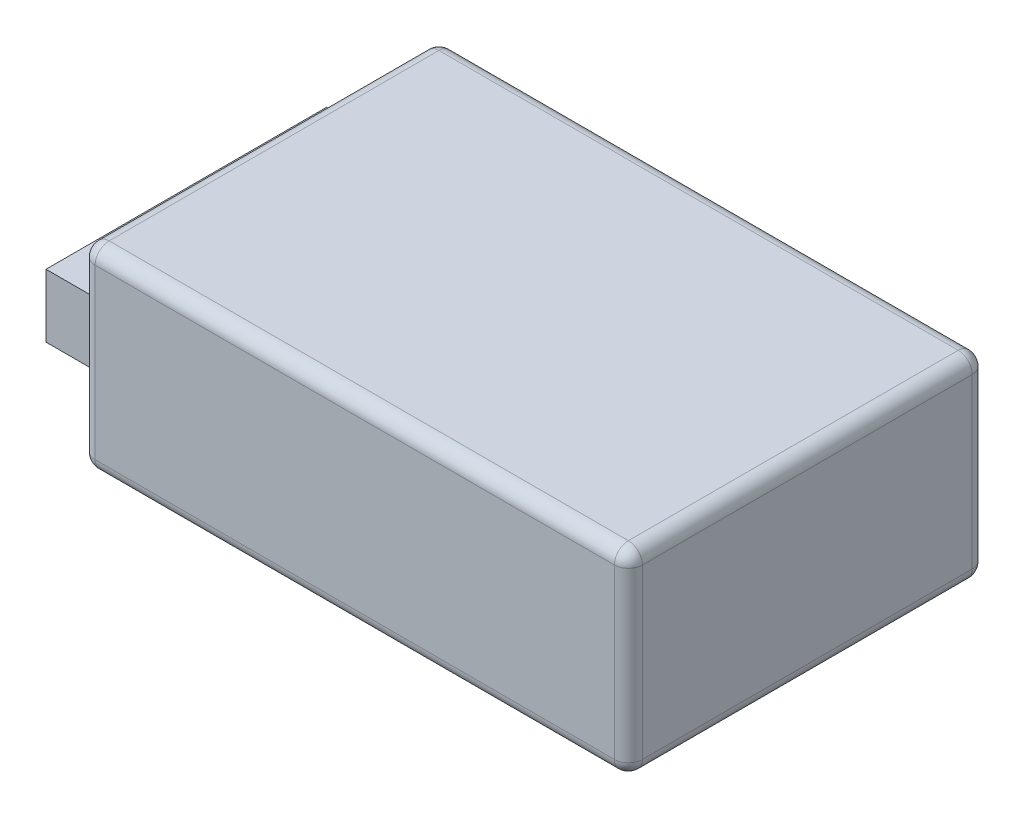
ISO-10303-21;
HEADER;
FILE_DESCRIPTION(('STEP AP214'),'2;1');
FILE_NAME('part.step','',(''),(''),'','','');
FILE_SCHEMA(('AUTOMOTIVE_DESIGN { 1 0 10303 214 1 1 1 1 }'));
ENDSEC;
DATA;
#1=APPLICATION_CONTEXT('core data for automotive mechanical design processes');
#2=APPLICATION_PROTOCOL_DEFINITION('international standard','automotive_design',2000,#1);
#3=PRODUCT_CONTEXT('',#1,'mechanical');
#4=PRODUCT('Part','Part','',(#3));
#5=PRODUCT_RELATED_PRODUCT_CATEGORY('part','',(#4));
#6=PRODUCT_DEFINITION_FORMATION('','',#4);
#7=PRODUCT_DEFINITION_CONTEXT('part definition',#1,'design');
#8=PRODUCT_DEFINITION('design','',#6,#7);
#9=PRODUCT_DEFINITION_SHAPE('','',#8);
#10=(LENGTH_UNIT() NAMED_UNIT(*) SI_UNIT(.MILLI.,.METRE.));
#11=(NAMED_UNIT(*) PLANE_ANGLE_UNIT() SI_UNIT($,.RADIAN.));
#12=(NAMED_UNIT(*) SI_UNIT($,.STERADIAN.) SOLID_ANGLE_UNIT());
#13=UNCERTAINTY_MEASURE_WITH_UNIT(LENGTH_MEASURE(1.E-05),#10,'distance_accuracy_value','');
#14=(GEOMETRIC_REPRESENTATION_CONTEXT(3) GLOBAL_UNCERTAINTY_ASSIGNED_CONTEXT((#13)) GLOBAL_UNIT_ASSIGNED_CONTEXT((#10,
#11,#12)) REPRESENTATION_CONTEXT('',''));
#15=CARTESIAN_POINT('',(0.,0.,0.));
#16=DIRECTION('',(0.,0.,1.));
#17=DIRECTION('',(1.,0.,0.));
#18=AXIS2_PLACEMENT_3D('',#15,#16,#17);
#19=CARTESIAN_POINT('',(-53.,4.,16.5));
#20=DIRECTION('',(0.,0.,-1.));
#21=DIRECTION('',(-1.,0.,0.));
#22=AXIS2_PLACEMENT_3D('',#19,#20,#21);
#23=PLANE('',#22);
#24=DIRECTION('',(0.,1.,0.));
#25=VECTOR('',#24,1.);
#26=CARTESIAN_POINT('',(-39.,4.,16.5));
#27=LINE('',#26,#25);
#28=CARTESIAN_POINT('',(-39.,4.,16.5));
#29=VERTEX_POINT('',#28);
#30=CARTESIAN_POINT('',(-39.,13.,16.5));
#31=VERTEX_POINT('',#30);
#32=EDGE_CURVE('E112',#29,#31,#27,.T.);
#33=ORIENTED_EDGE('',*,*,#32,.T.);
#34=DIRECTION('',(1.,0.,0.));
#35=VECTOR('',#34,1.);
#36=CARTESIAN_POINT('',(-53.,13.,16.5));
#37=LINE('',#36,#35);
#38=CARTESIAN_POINT('',(-53.,13.,16.5));
#39=VERTEX_POINT('',#38);
#40=EDGE_CURVE('E12',#39,#31,#37,.T.);
#41=ORIENTED_EDGE('',*,*,#40,.F.);
#42=DIRECTION('',(0.,1.,0.));
#43=VECTOR('',#42,1.);
#44=CARTESIAN_POINT('',(-53.,4.,16.5));
#45=LINE('',#44,#43);
#46=CARTESIAN_POINT('',(-53.,4.,16.5));
#47=VERTEX_POINT('',#46);
#48=EDGE_CURVE('E100',#47,#39,#45,.T.);
#49=ORIENTED_EDGE('',*,*,#48,.F.);
#50=DIRECTION('',(1.,0.,0.));
#51=VECTOR('',#50,1.);
#52=CARTESIAN_POINT('',(-53.,4.,16.5));
#53=LINE('',#52,#51);
#54=EDGE_CURVE('E108',#47,#29,#53,.T.);
#55=ORIENTED_EDGE('',*,*,#54,.T.);
#56=EDGE_LOOP('',(#33,#41,#49,#55));
#57=FACE_BOUND('',#56,.T.);
#58=ADVANCED_FACE('F49',(#57),#23,.F.);
#59=CARTESIAN_POINT('',(-53.,13.,-23.5));
#60=DIRECTION('',(0.,-1.,0.));
#61=DIRECTION('',(0.,0.,-1.));
#62=AXIS2_PLACEMENT_3D('',#59,#60,#61);
#63=PLANE('',#62);
#64=DIRECTION('',(0.,0.,-1.));
#65=VECTOR('',#64,1.);
#66=CARTESIAN_POINT('',(-39.,13.,-23.5));
#67=LINE('',#66,#65);
#68=CARTESIAN_POINT('',(-39.,13.,-23.5));
#69=VERTEX_POINT('',#68);
#70=EDGE_CURVE('E104',#31,#69,#67,.T.);
#71=ORIENTED_EDGE('',*,*,#70,.T.);
#72=DIRECTION('',(1.,0.,0.));
#73=VECTOR('',#72,1.);
#74=CARTESIAN_POINT('',(-53.,13.,-23.5));
#75=LINE('',#74,#73);
#76=CARTESIAN_POINT('',(-53.,13.,-23.5));
#77=VERTEX_POINT('',#76);
#78=EDGE_CURVE('E57',#77,#69,#75,.T.);
#79=ORIENTED_EDGE('',*,*,#78,.F.);
#80=DIRECTION('',(0.,0.,-1.));
#81=VECTOR('',#80,1.);
#82=CARTESIAN_POINT('',(-53.,13.,-23.5));
#83=LINE('',#82,#81);
#84=EDGE_CURVE('E95',#39,#77,#83,.T.);
#85=ORIENTED_EDGE('',*,*,#84,.F.);
#86=ORIENTED_EDGE('',*,*,#40,.T.);
#87=EDGE_LOOP('',(#71,#79,#85,#86));
#88=FACE_BOUND('',#87,.T.);
#89=ADVANCED_FACE('F103',(#88),#63,.F.);
#90=CARTESIAN_POINT('',(-53.,4.,-23.5));
#91=DIRECTION('',(0.,0.,1.));
#92=DIRECTION('',(1.,0.,0.));
#93=AXIS2_PLACEMENT_3D('',#90,#91,#92);
#94=PLANE('',#93);
#95=DIRECTION('',(0.,-1.,0.));
#96=VECTOR('',#95,1.);
#97=CARTESIAN_POINT('',(-39.,4.,-23.5));
#98=LINE('',#97,#96);
#99=CARTESIAN_POINT('',(-39.,4.,-23.5));
#100=VERTEX_POINT('',#99);
#101=EDGE_CURVE('E82',#69,#100,#98,.T.);
#102=ORIENTED_EDGE('',*,*,#101,.T.);
#103=DIRECTION('',(1.,0.,0.));
#104=VECTOR('',#103,1.);
#105=CARTESIAN_POINT('',(-53.,4.,-23.5));
#106=LINE('',#105,#104);
#107=CARTESIAN_POINT('',(-53.,4.,-23.5));
#108=VERTEX_POINT('',#107);
#109=EDGE_CURVE('E105',#108,#100,#106,.T.);
#110=ORIENTED_EDGE('',*,*,#109,.F.);
#111=DIRECTION('',(0.,-1.,0.));
#112=VECTOR('',#111,1.);
#113=CARTESIAN_POINT('',(-53.,4.,-23.5));
#114=LINE('',#113,#112);
#115=EDGE_CURVE('E98',#77,#108,#114,.T.);
#116=ORIENTED_EDGE('',*,*,#115,.F.);
#117=ORIENTED_EDGE('',*,*,#78,.T.);
#118=EDGE_LOOP('',(#102,#110,#116,#117));
#119=FACE_BOUND('',#118,.T.);
#120=ADVANCED_FACE('F106',(#119),#94,.F.);
#121=CARTESIAN_POINT('',(-53.,4.,-23.5));
#122=DIRECTION('',(0.,1.,0.));
#123=DIRECTION('',(0.,0.,1.));
#124=AXIS2_PLACEMENT_3D('',#121,#122,#123);
#125=PLANE('',#124);
#126=DIRECTION('',(0.,0.,1.));
#127=VECTOR('',#126,1.);
#128=CARTESIAN_POINT('',(-39.,4.,-23.5));
#129=LINE('',#128,#127);
#130=EDGE_CURVE('E88',#100,#29,#129,.T.);
#131=ORIENTED_EDGE('',*,*,#130,.T.);
#132=ORIENTED_EDGE('',*,*,#54,.F.);
#133=DIRECTION('',(0.,0.,1.));
#134=VECTOR('',#133,1.);
#135=CARTESIAN_POINT('',(-53.,4.,-23.5));
#136=LINE('',#135,#134);
#137=EDGE_CURVE('E65',#108,#47,#136,.T.);
#138=ORIENTED_EDGE('',*,*,#137,.F.);
#139=ORIENTED_EDGE('',*,*,#109,.T.);
#140=EDGE_LOOP('',(#131,#132,#138,#139));
#141=FACE_BOUND('',#140,.T.);
#142=ADVANCED_FACE('F119',(#141),#125,.F.);
#143=CARTESIAN_POINT('',(-53.,0.,0.));
#144=DIRECTION('',(1.,0.,0.));
#145=DIRECTION('',(0.,0.,-1.));
#146=AXIS2_PLACEMENT_3D('',#143,#144,#145);
#147=PLANE('',#146);
#148=ORIENTED_EDGE('',*,*,#48,.T.);
#149=ORIENTED_EDGE('',*,*,#84,.T.);
#150=ORIENTED_EDGE('',*,*,#115,.T.);
#151=ORIENTED_EDGE('',*,*,#137,.T.);
#152=EDGE_LOOP('',(#148,#149,#150,#151));
#153=FACE_BOUND('',#152,.T.);
#154=ADVANCED_FACE('F96',(#153),#147,.F.);
#155=CARTESIAN_POINT('',(-39.,0.,0.));
#156=DIRECTION('',(1.,0.,0.));
#157=DIRECTION('',(0.,0.,-1.));
#158=AXIS2_PLACEMENT_3D('',#155,#156,#157);
#159=PLANE('',#158);
#160=ORIENTED_EDGE('',*,*,#32,.F.);
#161=ORIENTED_EDGE('',*,*,#130,.F.);
#162=ORIENTED_EDGE('',*,*,#101,.F.);
#163=ORIENTED_EDGE('',*,*,#70,.F.);
#164=EDGE_LOOP('',(#160,#161,#162,#163));
#165=FACE_BOUND('',#164,.T.);
#166=ADVANCED_FACE('F122',(#165),#159,.T.);
#167=CLOSED_SHELL('',(#58,#89,#120,#142,#154,#166));
#168=MANIFOLD_SOLID_BREP('B2',#167);
#169=CARTESIAN_POINT('',(39.,28.,25.5));
#170=DIRECTION('',(-1.,0.,0.));
#171=DIRECTION('',(0.,0.,1.));
#172=AXIS2_PLACEMENT_3D('',#169,#170,#171);
#173=PLANE('',#172);
#174=DIRECTION('',(0.,-1.,0.));
#175=VECTOR('',#174,1.);
#176=CARTESIAN_POINT('',(39.,28.,23.5));
#177=LINE('',#176,#175);
#178=CARTESIAN_POINT('',(39.,26.,23.5));
#179=VERTEX_POINT('',#178);
#180=CARTESIAN_POINT('',(39.,2.,23.5));
#181=VERTEX_POINT('',#180);
#182=EDGE_CURVE('E324',#179,#181,#177,.T.);
#183=ORIENTED_EDGE('',*,*,#182,.T.);
#184=DIRECTION('',(0.,0.,-1.));
#185=VECTOR('',#184,1.);
#186=CARTESIAN_POINT('',(39.,2.,-25.5));
#187=LINE('',#186,#185);
#188=CARTESIAN_POINT('',(39.,2.,-23.5));
#189=VERTEX_POINT('',#188);
#190=EDGE_CURVE('E327',#181,#189,#187,.T.);
#191=ORIENTED_EDGE('',*,*,#190,.T.);
#192=DIRECTION('',(0.,-1.,0.));
#193=VECTOR('',#192,1.);
#194=CARTESIAN_POINT('',(39.,28.,-23.5));
#195=LINE('',#194,#193);
#196=CARTESIAN_POINT('',(39.,26.,-23.5));
#197=VERTEX_POINT('',#196);
#198=EDGE_CURVE('E322',#189,#197,#195,.F.);
#199=ORIENTED_EDGE('',*,*,#198,.T.);
#200=DIRECTION('',(0.,0.,-1.));
#201=VECTOR('',#200,1.);
#202=CARTESIAN_POINT('',(39.,26.,25.5));
#203=LINE('',#202,#201);
#204=EDGE_CURVE('E320',#197,#179,#203,.F.);
#205=ORIENTED_EDGE('',*,*,#204,.T.);
#206=EDGE_LOOP('',(#183,#191,#199,#205));
#207=FACE_BOUND('',#206,.T.);
#208=ADVANCED_FACE('F173',(#207),#173,.F.);
#209=CARTESIAN_POINT('',(-39.,28.,-25.5));
#210=DIRECTION('',(0.,0.,1.));
#211=DIRECTION('',(1.,0.,0.));
#212=AXIS2_PLACEMENT_3D('',#209,#210,#211);
#213=PLANE('',#212);
#214=DIRECTION('',(0.,-1.,0.));
#215=VECTOR('',#214,1.);
#216=CARTESIAN_POINT('',(37.,28.,-25.5));
#217=LINE('',#216,#215);
#218=CARTESIAN_POINT('',(37.,26.,-25.5));
#219=VERTEX_POINT('',#218);
#220=CARTESIAN_POINT('',(37.,2.,-25.5));
#221=VERTEX_POINT('',#220);
#222=EDGE_CURVE('E306',#219,#221,#217,.T.);
#223=ORIENTED_EDGE('',*,*,#222,.T.);
#224=DIRECTION('',(-1.,0.,0.));
#225=VECTOR('',#224,1.);
#226=CARTESIAN_POINT('',(-39.,2.,-25.5));
#227=LINE('',#226,#225);
#228=CARTESIAN_POINT('',(-37.,2.,-25.5));
#229=VERTEX_POINT('',#228);
#230=EDGE_CURVE('E311',#221,#229,#227,.T.);
#231=ORIENTED_EDGE('',*,*,#230,.T.);
#232=DIRECTION('',(0.,-1.,0.));
#233=VECTOR('',#232,1.);
#234=CARTESIAN_POINT('',(-37.,28.,-25.5));
#235=LINE('',#234,#233);
#236=CARTESIAN_POINT('',(-37.,26.,-25.5));
#237=VERTEX_POINT('',#236);
#238=EDGE_CURVE('E308',#229,#237,#235,.F.);
#239=ORIENTED_EDGE('',*,*,#238,.T.);
#240=DIRECTION('',(-1.,0.,0.));
#241=VECTOR('',#240,1.);
#242=CARTESIAN_POINT('',(-39.,26.,-25.5));
#243=LINE('',#242,#241);
#244=EDGE_CURVE('E304',#237,#219,#243,.F.);
#245=ORIENTED_EDGE('',*,*,#244,.T.);
#246=EDGE_LOOP('',(#223,#231,#239,#245));
#247=FACE_BOUND('',#246,.T.);
#248=ADVANCED_FACE('F445',(#247),#213,.F.);
#249=CARTESIAN_POINT('',(-39.,28.,25.5));
#250=DIRECTION('',(1.,0.,0.));
#251=DIRECTION('',(0.,0.,-1.));
#252=AXIS2_PLACEMENT_3D('',#249,#250,#251);
#253=PLANE('',#252);
#254=DIRECTION('',(0.,-1.,0.));
#255=VECTOR('',#254,1.);
#256=CARTESIAN_POINT('',(-39.,28.,-23.5));
#257=LINE('',#256,#255);
#258=CARTESIAN_POINT('',(-39.,26.,-23.5));
#259=VERTEX_POINT('',#258);
#260=CARTESIAN_POINT('',(-39.,2.,-23.5));
#261=VERTEX_POINT('',#260);
#262=EDGE_CURVE('E272',#259,#261,#257,.T.);
#263=ORIENTED_EDGE('',*,*,#262,.T.);
#264=DIRECTION('',(0.,0.,1.));
#265=VECTOR('',#264,1.);
#266=CARTESIAN_POINT('',(-39.,2.,25.5));
#267=LINE('',#266,#265);
#268=CARTESIAN_POINT('',(-39.,2.,23.5));
#269=VERTEX_POINT('',#268);
#270=EDGE_CURVE('E268',#261,#269,#267,.T.);
#271=ORIENTED_EDGE('',*,*,#270,.T.);
#272=DIRECTION('',(0.,-1.,0.));
#273=VECTOR('',#272,1.);
#274=CARTESIAN_POINT('',(-39.,28.,23.5));
#275=LINE('',#274,#273);
#276=CARTESIAN_POINT('',(-39.,26.,23.5));
#277=VERTEX_POINT('',#276);
#278=EDGE_CURVE('E260',#269,#277,#275,.F.);
#279=ORIENTED_EDGE('',*,*,#278,.T.);
#280=DIRECTION('',(0.,0.,1.));
#281=VECTOR('',#280,1.);
#282=CARTESIAN_POINT('',(-39.,26.,25.5));
#283=LINE('',#282,#281);
#284=EDGE_CURVE('E265',#277,#259,#283,.F.);
#285=ORIENTED_EDGE('',*,*,#284,.T.);
#286=EDGE_LOOP('',(#263,#271,#279,#285));
#287=FACE_BOUND('',#286,.T.);
#288=ADVANCED_FACE('F263',(#287),#253,.F.);
#289=CARTESIAN_POINT('',(-39.,28.,25.5));
#290=DIRECTION('',(0.,0.,-1.));
#291=DIRECTION('',(-1.,0.,0.));
#292=AXIS2_PLACEMENT_3D('',#289,#290,#291);
#293=PLANE('',#292);
#294=DIRECTION('',(0.,-1.,0.));
#295=VECTOR('',#294,1.);
#296=CARTESIAN_POINT('',(-37.,28.,25.5));
#297=LINE('',#296,#295);
#298=CARTESIAN_POINT('',(-37.,26.,25.5));
#299=VERTEX_POINT('',#298);
#300=CARTESIAN_POINT('',(-37.,2.,25.5));
#301=VERTEX_POINT('',#300);
#302=EDGE_CURVE('E280',#299,#301,#297,.T.);
#303=ORIENTED_EDGE('',*,*,#302,.T.);
#304=DIRECTION('',(1.,0.,0.));
#305=VECTOR('',#304,1.);
#306=CARTESIAN_POINT('',(39.,2.,25.5));
#307=LINE('',#306,#305);
#308=CARTESIAN_POINT('',(37.,2.,25.5));
#309=VERTEX_POINT('',#308);
#310=EDGE_CURVE('E318',#301,#309,#307,.T.);
#311=ORIENTED_EDGE('',*,*,#310,.T.);
#312=DIRECTION('',(0.,-1.,0.));
#313=VECTOR('',#312,1.);
#314=CARTESIAN_POINT('',(37.,28.,25.5));
#315=LINE('',#314,#313);
#316=CARTESIAN_POINT('',(37.,26.,25.5));
#317=VERTEX_POINT('',#316);
#318=EDGE_CURVE('E315',#309,#317,#315,.F.);
#319=ORIENTED_EDGE('',*,*,#318,.T.);
#320=DIRECTION('',(1.,0.,0.));
#321=VECTOR('',#320,1.);
#322=CARTESIAN_POINT('',(-39.,26.,25.5));
#323=LINE('',#322,#321);
#324=EDGE_CURVE('E313',#317,#299,#323,.F.);
#325=ORIENTED_EDGE('',*,*,#324,.T.);
#326=EDGE_LOOP('',(#303,#311,#319,#325));
#327=FACE_BOUND('',#326,.T.);
#328=ADVANCED_FACE('F436',(#327),#293,.F.);
#329=CARTESIAN_POINT('',(0.,28.,0.));
#330=DIRECTION('',(0.,-1.,0.));
#331=DIRECTION('',(0.,0.,-1.));
#332=AXIS2_PLACEMENT_3D('',#329,#330,#331);
#333=PLANE('',#332);
#334=DIRECTION('',(0.,0.,1.));
#335=VECTOR('',#334,1.);
#336=CARTESIAN_POINT('',(-37.,28.,0.));
#337=LINE('',#336,#335);
#338=CARTESIAN_POINT('',(-37.,28.,-23.5));
#339=VERTEX_POINT('',#338);
#340=CARTESIAN_POINT('',(-37.,28.,23.5));
#341=VERTEX_POINT('',#340);
#342=EDGE_CURVE('E182',#339,#341,#337,.T.);
#343=ORIENTED_EDGE('',*,*,#342,.T.);
#344=DIRECTION('',(1.,0.,0.));
#345=VECTOR('',#344,1.);
#346=CARTESIAN_POINT('',(0.,28.,23.5));
#347=LINE('',#346,#345);
#348=CARTESIAN_POINT('',(37.,28.,23.5));
#349=VERTEX_POINT('',#348);
#350=EDGE_CURVE('E47',#341,#349,#347,.T.);
#351=ORIENTED_EDGE('',*,*,#350,.T.);
#352=DIRECTION('',(0.,0.,-1.));
#353=VECTOR('',#352,1.);
#354=CARTESIAN_POINT('',(37.,28.,0.));
#355=LINE('',#354,#353);
#356=CARTESIAN_POINT('',(37.,28.,-23.5));
#357=VERTEX_POINT('',#356);
#358=EDGE_CURVE('E338',#349,#357,#355,.T.);
#359=ORIENTED_EDGE('',*,*,#358,.T.);
#360=DIRECTION('',(-1.,0.,0.));
#361=VECTOR('',#360,1.);
#362=CARTESIAN_POINT('',(0.,28.,-23.5));
#363=LINE('',#362,#361);
#364=EDGE_CURVE('E193',#357,#339,#363,.T.);
#365=ORIENTED_EDGE('',*,*,#364,.T.);
#366=EDGE_LOOP('',(#343,#351,#359,#365));
#367=FACE_BOUND('',#366,.T.);
#368=ADVANCED_FACE('F438',(#367),#333,.F.);
#369=CARTESIAN_POINT('',(0.,0.,0.));
#370=DIRECTION('',(0.,-1.,0.));
#371=DIRECTION('',(0.,0.,-1.));
#372=AXIS2_PLACEMENT_3D('',#369,#370,#371);
#373=PLANE('',#372);
#374=DIRECTION('',(0.,0.,1.));
#375=VECTOR('',#374,1.);
#376=CARTESIAN_POINT('',(-37.,0.,-25.5));
#377=LINE('',#376,#375);
#378=CARTESIAN_POINT('',(-37.,0.,23.5));
#379=VERTEX_POINT('',#378);
#380=CARTESIAN_POINT('',(-37.,0.,-23.5));
#381=VERTEX_POINT('',#380);
#382=EDGE_CURVE('E333',#379,#381,#377,.F.);
#383=ORIENTED_EDGE('',*,*,#382,.T.);
#384=DIRECTION('',(-1.,0.,0.));
#385=VECTOR('',#384,1.);
#386=CARTESIAN_POINT('',(39.,0.,-23.5));
#387=LINE('',#386,#385);
#388=CARTESIAN_POINT('',(37.,0.,-23.5));
#389=VERTEX_POINT('',#388);
#390=EDGE_CURVE('E335',#381,#389,#387,.F.);
#391=ORIENTED_EDGE('',*,*,#390,.T.);
#392=DIRECTION('',(0.,0.,-1.));
#393=VECTOR('',#392,1.);
#394=CARTESIAN_POINT('',(37.,0.,25.5));
#395=LINE('',#394,#393);
#396=CARTESIAN_POINT('',(37.,0.,23.5));
#397=VERTEX_POINT('',#396);
#398=EDGE_CURVE('E329',#389,#397,#395,.F.);
#399=ORIENTED_EDGE('',*,*,#398,.T.);
#400=DIRECTION('',(1.,0.,0.));
#401=VECTOR('',#400,1.);
#402=CARTESIAN_POINT('',(-39.,0.,23.5));
#403=LINE('',#402,#401);
#404=EDGE_CURVE('E331',#397,#379,#403,.F.);
#405=ORIENTED_EDGE('',*,*,#404,.T.);
#406=EDGE_LOOP('',(#383,#391,#399,#405));
#407=FACE_BOUND('',#406,.T.);
#408=ADVANCED_FACE('F405',(#407),#373,.T.);
#409=CARTESIAN_POINT('',(37.,28.,23.5));
#410=DIRECTION('',(0.,-1.,0.));
#411=DIRECTION('',(0.,0.,-1.));
#412=AXIS2_PLACEMENT_3D('',#409,#410,#411);
#413=CYLINDRICAL_SURFACE('',#412,2.);
#414=CARTESIAN_POINT('',(37.,26.,23.5));
#415=DIRECTION('',(0.,1.,0.));
#416=DIRECTION('',(0.,0.,1.));
#417=AXIS2_PLACEMENT_3D('',#414,#415,#416);
#418=CIRCLE('',#417,2.);
#419=EDGE_CURVE('E177',#317,#179,#418,.T.);
#420=ORIENTED_EDGE('',*,*,#419,.F.);
#421=ORIENTED_EDGE('',*,*,#318,.F.);
#422=CARTESIAN_POINT('',(37.,2.,23.5));
#423=DIRECTION('',(0.,-1.,0.));
#424=DIRECTION('',(0.,0.,-1.));
#425=AXIS2_PLACEMENT_3D('',#422,#423,#424);
#426=CIRCLE('',#425,2.);
#427=EDGE_CURVE('E300',#181,#309,#426,.T.);
#428=ORIENTED_EDGE('',*,*,#427,.F.);
#429=ORIENTED_EDGE('',*,*,#182,.F.);
#430=EDGE_LOOP('',(#420,#421,#428,#429));
#431=FACE_BOUND('',#430,.T.);
#432=ADVANCED_FACE('F175',(#431),#413,.T.);
#433=CARTESIAN_POINT('',(37.,26.,23.5));
#434=DIRECTION('',(1.,0.,0.));
#435=DIRECTION('',(0.,0.,-1.));
#436=AXIS2_PLACEMENT_3D('',#433,#434,#435);
#437=SPHERICAL_SURFACE('',#436,2.);
#438=CARTESIAN_POINT('',(37.,26.,23.5));
#439=DIRECTION('',(1.,0.,0.));
#440=DIRECTION('',(0.,0.,-1.));
#441=AXIS2_PLACEMENT_3D('',#438,#439,#440);
#442=CIRCLE('',#441,2.);
#443=EDGE_CURVE('E384',#317,#349,#442,.F.);
#444=ORIENTED_EDGE('',*,*,#443,.F.);
#445=ORIENTED_EDGE('',*,*,#419,.T.);
#446=CARTESIAN_POINT('',(37.,26.,23.5));
#447=DIRECTION('',(0.,0.,1.));
#448=DIRECTION('',(1.,0.,0.));
#449=AXIS2_PLACEMENT_3D('',#446,#447,#448);
#450=CIRCLE('',#449,2.);
#451=EDGE_CURVE('E387',#349,#179,#450,.F.);
#452=ORIENTED_EDGE('',*,*,#451,.F.);
#453=EDGE_LOOP('',(#444,#445,#452));
#454=FACE_BOUND('',#453,.T.);
#455=ADVANCED_FACE('F431',(#454),#437,.T.);
#456=CARTESIAN_POINT('',(37.,2.,23.5));
#457=DIRECTION('',(0.,0.,1.));
#458=DIRECTION('',(0.,-1.,0.));
#459=AXIS2_PLACEMENT_3D('',#456,#457,#458);
#460=SPHERICAL_SURFACE('',#459,2.);
#461=CARTESIAN_POINT('',(37.,2.,23.5));
#462=DIRECTION('',(0.,0.,1.));
#463=DIRECTION('',(1.,0.,0.));
#464=AXIS2_PLACEMENT_3D('',#461,#462,#463);
#465=CIRCLE('',#464,2.);
#466=EDGE_CURVE('E378',#181,#397,#465,.F.);
#467=ORIENTED_EDGE('',*,*,#466,.F.);
#468=ORIENTED_EDGE('',*,*,#427,.T.);
#469=CARTESIAN_POINT('',(37.,2.,23.5));
#470=DIRECTION('',(1.,0.,0.));
#471=DIRECTION('',(0.,0.,-1.));
#472=AXIS2_PLACEMENT_3D('',#469,#470,#471);
#473=CIRCLE('',#472,2.);
#474=EDGE_CURVE('E381',#397,#309,#473,.F.);
#475=ORIENTED_EDGE('',*,*,#474,.F.);
#476=EDGE_LOOP('',(#467,#468,#475));
#477=FACE_BOUND('',#476,.T.);
#478=ADVANCED_FACE('F394',(#477),#460,.T.);
#479=CARTESIAN_POINT('',(37.,26.,0.));
#480=DIRECTION('',(0.,0.,-1.));
#481=DIRECTION('',(-1.,0.,0.));
#482=AXIS2_PLACEMENT_3D('',#479,#480,#481);
#483=CYLINDRICAL_SURFACE('',#482,2.);
#484=ORIENTED_EDGE('',*,*,#451,.T.);
#485=ORIENTED_EDGE('',*,*,#204,.F.);
#486=CARTESIAN_POINT('',(37.,26.,-23.5));
#487=DIRECTION('',(0.,0.,-1.));
#488=DIRECTION('',(-1.,0.,0.));
#489=AXIS2_PLACEMENT_3D('',#486,#487,#488);
#490=CIRCLE('',#489,2.);
#491=EDGE_CURVE('E372',#357,#197,#490,.T.);
#492=ORIENTED_EDGE('',*,*,#491,.F.);
#493=ORIENTED_EDGE('',*,*,#358,.F.);
#494=EDGE_LOOP('',(#484,#485,#492,#493));
#495=FACE_BOUND('',#494,.T.);
#496=ADVANCED_FACE('F426',(#495),#483,.T.);
#497=CARTESIAN_POINT('',(0.,26.,23.5));
#498=DIRECTION('',(1.,0.,0.));
#499=DIRECTION('',(0.,0.,-1.));
#500=AXIS2_PLACEMENT_3D('',#497,#498,#499);
#501=CYLINDRICAL_SURFACE('',#500,2.);
#502=ORIENTED_EDGE('',*,*,#443,.T.);
#503=ORIENTED_EDGE('',*,*,#350,.F.);
#504=CARTESIAN_POINT('',(-37.,26.,23.5));
#505=DIRECTION('',(-1.,0.,0.));
#506=DIRECTION('',(0.,0.,1.));
#507=AXIS2_PLACEMENT_3D('',#504,#505,#506);
#508=CIRCLE('',#507,2.);
#509=EDGE_CURVE('E284',#299,#341,#508,.T.);
#510=ORIENTED_EDGE('',*,*,#509,.F.);
#511=ORIENTED_EDGE('',*,*,#324,.F.);
#512=EDGE_LOOP('',(#502,#503,#510,#511));
#513=FACE_BOUND('',#512,.T.);
#514=ADVANCED_FACE('F434',(#513),#501,.T.);
#515=CARTESIAN_POINT('',(-37.,28.,23.5));
#516=DIRECTION('',(0.,-1.,0.));
#517=DIRECTION('',(0.,0.,-1.));
#518=AXIS2_PLACEMENT_3D('',#515,#516,#517);
#519=CYLINDRICAL_SURFACE('',#518,2.);
#520=CARTESIAN_POINT('',(-37.,2.,23.5));
#521=DIRECTION('',(0.,-1.,0.));
#522=DIRECTION('',(0.,0.,-1.));
#523=AXIS2_PLACEMENT_3D('',#520,#521,#522);
#524=CIRCLE('',#523,2.);
#525=EDGE_CURVE('E285',#301,#269,#524,.T.);
#526=ORIENTED_EDGE('',*,*,#525,.F.);
#527=ORIENTED_EDGE('',*,*,#302,.F.);
#528=CARTESIAN_POINT('',(-37.,26.,23.5));
#529=DIRECTION('',(0.,1.,0.));
#530=DIRECTION('',(0.,0.,1.));
#531=AXIS2_PLACEMENT_3D('',#528,#529,#530);
#532=CIRCLE('',#531,2.);
#533=EDGE_CURVE('E276',#277,#299,#532,.T.);
#534=ORIENTED_EDGE('',*,*,#533,.F.);
#535=ORIENTED_EDGE('',*,*,#278,.F.);
#536=EDGE_LOOP('',(#526,#527,#534,#535));
#537=FACE_BOUND('',#536,.T.);
#538=ADVANCED_FACE('F278',(#537),#519,.T.);
#539=CARTESIAN_POINT('',(-39.,2.,23.5));
#540=DIRECTION('',(-1.,0.,0.));
#541=DIRECTION('',(0.,0.,1.));
#542=AXIS2_PLACEMENT_3D('',#539,#540,#541);
#543=CYLINDRICAL_SURFACE('',#542,2.);
#544=ORIENTED_EDGE('',*,*,#474,.T.);
#545=ORIENTED_EDGE('',*,*,#310,.F.);
#546=CARTESIAN_POINT('',(-37.,2.,23.5));
#547=DIRECTION('',(-1.,0.,0.));
#548=DIRECTION('',(0.,0.,1.));
#549=AXIS2_PLACEMENT_3D('',#546,#547,#548);
#550=CIRCLE('',#549,2.);
#551=EDGE_CURVE('E368',#379,#301,#550,.T.);
#552=ORIENTED_EDGE('',*,*,#551,.F.);
#553=ORIENTED_EDGE('',*,*,#404,.F.);
#554=EDGE_LOOP('',(#544,#545,#552,#553));
#555=FACE_BOUND('',#554,.T.);
#556=ADVANCED_FACE('F401',(#555),#543,.T.);
#557=CARTESIAN_POINT('',(37.,2.,25.5));
#558=DIRECTION('',(0.,0.,1.));
#559=DIRECTION('',(1.,0.,0.));
#560=AXIS2_PLACEMENT_3D('',#557,#558,#559);
#561=CYLINDRICAL_SURFACE('',#560,2.);
#562=ORIENTED_EDGE('',*,*,#466,.T.);
#563=ORIENTED_EDGE('',*,*,#398,.F.);
#564=CARTESIAN_POINT('',(37.,2.,-23.5));
#565=DIRECTION('',(0.,0.,-1.));
#566=DIRECTION('',(-1.,0.,0.));
#567=AXIS2_PLACEMENT_3D('',#564,#565,#566);
#568=CIRCLE('',#567,2.);
#569=EDGE_CURVE('E365',#189,#389,#568,.T.);
#570=ORIENTED_EDGE('',*,*,#569,.F.);
#571=ORIENTED_EDGE('',*,*,#190,.F.);
#572=EDGE_LOOP('',(#562,#563,#570,#571));
#573=FACE_BOUND('',#572,.T.);
#574=ADVANCED_FACE('F411',(#573),#561,.T.);
#575=CARTESIAN_POINT('',(37.,28.,-23.5));
#576=DIRECTION('',(0.,-1.,0.));
#577=DIRECTION('',(0.,0.,-1.));
#578=AXIS2_PLACEMENT_3D('',#575,#576,#577);
#579=CYLINDRICAL_SURFACE('',#578,2.);
#580=CARTESIAN_POINT('',(37.,26.,-23.5));
#581=DIRECTION('',(0.,1.,0.));
#582=DIRECTION('',(0.,0.,1.));
#583=AXIS2_PLACEMENT_3D('',#580,#581,#582);
#584=CIRCLE('',#583,2.);
#585=EDGE_CURVE('E375',#197,#219,#584,.T.);
#586=ORIENTED_EDGE('',*,*,#585,.F.);
#587=ORIENTED_EDGE('',*,*,#198,.F.);
#588=CARTESIAN_POINT('',(37.,2.,-23.5));
#589=DIRECTION('',(0.,-1.,0.));
#590=DIRECTION('',(0.,0.,-1.));
#591=AXIS2_PLACEMENT_3D('',#588,#589,#590);
#592=CIRCLE('',#591,2.);
#593=EDGE_CURVE('E362',#221,#189,#592,.T.);
#594=ORIENTED_EDGE('',*,*,#593,.F.);
#595=ORIENTED_EDGE('',*,*,#222,.F.);
#596=EDGE_LOOP('',(#586,#587,#594,#595));
#597=FACE_BOUND('',#596,.T.);
#598=ADVANCED_FACE('F418',(#597),#579,.T.);
#599=CARTESIAN_POINT('',(37.,26.,-23.5));
#600=DIRECTION('',(1.,0.,0.));
#601=DIRECTION('',(0.,0.,-1.));
#602=AXIS2_PLACEMENT_3D('',#599,#600,#601);
#603=SPHERICAL_SURFACE('',#602,2.);
#604=ORIENTED_EDGE('',*,*,#491,.T.);
#605=ORIENTED_EDGE('',*,*,#585,.T.);
#606=CARTESIAN_POINT('',(37.,26.,-23.5));
#607=DIRECTION('',(1.,0.,0.));
#608=DIRECTION('',(0.,0.,-1.));
#609=AXIS2_PLACEMENT_3D('',#606,#607,#608);
#610=CIRCLE('',#609,2.);
#611=EDGE_CURVE('E291',#357,#219,#610,.F.);
#612=ORIENTED_EDGE('',*,*,#611,.F.);
#613=EDGE_LOOP('',(#604,#605,#612));
#614=FACE_BOUND('',#613,.T.);
#615=ADVANCED_FACE('F424',(#614),#603,.T.);
#616=CARTESIAN_POINT('',(-37.,26.,23.5));
#617=DIRECTION('',(0.,0.,1.));
#618=DIRECTION('',(1.,0.,0.));
#619=AXIS2_PLACEMENT_3D('',#616,#617,#618);
#620=SPHERICAL_SURFACE('',#619,2.);
#621=ORIENTED_EDGE('',*,*,#533,.T.);
#622=ORIENTED_EDGE('',*,*,#509,.T.);
#623=CARTESIAN_POINT('',(-37.,26.,23.5));
#624=DIRECTION('',(0.,0.,1.));
#625=DIRECTION('',(1.,0.,0.));
#626=AXIS2_PLACEMENT_3D('',#623,#624,#625);
#627=CIRCLE('',#626,2.);
#628=EDGE_CURVE('E288',#277,#341,#627,.F.);
#629=ORIENTED_EDGE('',*,*,#628,.F.);
#630=EDGE_LOOP('',(#621,#622,#629));
#631=FACE_BOUND('',#630,.T.);
#632=ADVANCED_FACE('F289',(#631),#620,.T.);
#633=CARTESIAN_POINT('',(-37.,2.,23.5));
#634=DIRECTION('',(0.,0.,1.));
#635=DIRECTION('',(0.,-1.,0.));
#636=AXIS2_PLACEMENT_3D('',#633,#634,#635);
#637=SPHERICAL_SURFACE('',#636,2.);
#638=ORIENTED_EDGE('',*,*,#551,.T.);
#639=ORIENTED_EDGE('',*,*,#525,.T.);
#640=CARTESIAN_POINT('',(-37.,2.,23.5));
#641=DIRECTION('',(0.,0.,1.));
#642=DIRECTION('',(1.,0.,0.));
#643=AXIS2_PLACEMENT_3D('',#640,#641,#642);
#644=CIRCLE('',#643,2.);
#645=EDGE_CURVE('E292',#379,#269,#644,.F.);
#646=ORIENTED_EDGE('',*,*,#645,.F.);
#647=EDGE_LOOP('',(#638,#639,#646));
#648=FACE_BOUND('',#647,.T.);
#649=ADVANCED_FACE('F485',(#648),#637,.T.);
#650=CARTESIAN_POINT('',(37.,2.,-23.5));
#651=DIRECTION('',(1.,0.,0.));
#652=DIRECTION('',(0.,1.,0.));
#653=AXIS2_PLACEMENT_3D('',#650,#651,#652);
#654=SPHERICAL_SURFACE('',#653,2.);
#655=ORIENTED_EDGE('',*,*,#593,.T.);
#656=ORIENTED_EDGE('',*,*,#569,.T.);
#657=CARTESIAN_POINT('',(37.,2.,-23.5));
#658=DIRECTION('',(1.,0.,0.));
#659=DIRECTION('',(0.,0.,-1.));
#660=AXIS2_PLACEMENT_3D('',#657,#658,#659);
#661=CIRCLE('',#660,2.);
#662=EDGE_CURVE('E356',#221,#389,#661,.F.);
#663=ORIENTED_EDGE('',*,*,#662,.F.);
#664=EDGE_LOOP('',(#655,#656,#663));
#665=FACE_BOUND('',#664,.T.);
#666=ADVANCED_FACE('F481',(#665),#654,.T.);
#667=CARTESIAN_POINT('',(0.,26.,-23.5));
#668=DIRECTION('',(-1.,0.,0.));
#669=DIRECTION('',(0.,0.,1.));
#670=AXIS2_PLACEMENT_3D('',#667,#668,#669);
#671=CYLINDRICAL_SURFACE('',#670,2.);
#672=ORIENTED_EDGE('',*,*,#611,.T.);
#673=ORIENTED_EDGE('',*,*,#244,.F.);
#674=CARTESIAN_POINT('',(-37.,26.,-23.5));
#675=DIRECTION('',(-1.,0.,0.));
#676=DIRECTION('',(0.,0.,1.));
#677=AXIS2_PLACEMENT_3D('',#674,#675,#676);
#678=CIRCLE('',#677,2.);
#679=EDGE_CURVE('E353',#339,#237,#678,.T.);
#680=ORIENTED_EDGE('',*,*,#679,.F.);
#681=ORIENTED_EDGE('',*,*,#364,.F.);
#682=EDGE_LOOP('',(#672,#673,#680,#681));
#683=FACE_BOUND('',#682,.T.);
#684=ADVANCED_FACE('F478',(#683),#671,.T.);
#685=CARTESIAN_POINT('',(-37.,26.,0.));
#686=DIRECTION('',(0.,0.,1.));
#687=DIRECTION('',(1.,0.,0.));
#688=AXIS2_PLACEMENT_3D('',#685,#686,#687);
#689=CYLINDRICAL_SURFACE('',#688,2.);
#690=ORIENTED_EDGE('',*,*,#628,.T.);
#691=ORIENTED_EDGE('',*,*,#342,.F.);
#692=CARTESIAN_POINT('',(-37.,26.,-23.5));
#693=DIRECTION('',(0.,0.,-1.));
#694=DIRECTION('',(0.,1.,0.));
#695=AXIS2_PLACEMENT_3D('',#692,#693,#694);
#696=CIRCLE('',#695,2.);
#697=EDGE_CURVE('E296',#259,#339,#696,.T.);
#698=ORIENTED_EDGE('',*,*,#697,.F.);
#699=ORIENTED_EDGE('',*,*,#284,.F.);
#700=EDGE_LOOP('',(#690,#691,#698,#699));
#701=FACE_BOUND('',#700,.T.);
#702=ADVANCED_FACE('F294',(#701),#689,.T.);
#703=CARTESIAN_POINT('',(-37.,2.,25.5));
#704=DIRECTION('',(0.,0.,-1.));
#705=DIRECTION('',(-1.,0.,0.));
#706=AXIS2_PLACEMENT_3D('',#703,#704,#705);
#707=CYLINDRICAL_SURFACE('',#706,2.);
#708=ORIENTED_EDGE('',*,*,#645,.T.);
#709=ORIENTED_EDGE('',*,*,#270,.F.);
#710=CARTESIAN_POINT('',(-37.,2.,-23.5));
#711=DIRECTION('',(0.,0.,-1.));
#712=DIRECTION('',(-1.,0.,0.));
#713=AXIS2_PLACEMENT_3D('',#710,#711,#712);
#714=CIRCLE('',#713,2.);
#715=EDGE_CURVE('E349',#381,#261,#714,.T.);
#716=ORIENTED_EDGE('',*,*,#715,.F.);
#717=ORIENTED_EDGE('',*,*,#382,.F.);
#718=EDGE_LOOP('',(#708,#709,#716,#717));
#719=FACE_BOUND('',#718,.T.);
#720=ADVANCED_FACE('F471',(#719),#707,.T.);
#721=CARTESIAN_POINT('',(-39.,2.,-23.5));
#722=DIRECTION('',(1.,0.,0.));
#723=DIRECTION('',(0.,0.,-1.));
#724=AXIS2_PLACEMENT_3D('',#721,#722,#723);
#725=CYLINDRICAL_SURFACE('',#724,2.);
#726=ORIENTED_EDGE('',*,*,#662,.T.);
#727=ORIENTED_EDGE('',*,*,#390,.F.);
#728=CARTESIAN_POINT('',(-37.,2.,-23.5));
#729=DIRECTION('',(-1.,0.,0.));
#730=DIRECTION('',(0.,0.,1.));
#731=AXIS2_PLACEMENT_3D('',#728,#729,#730);
#732=CIRCLE('',#731,2.);
#733=EDGE_CURVE('E346',#229,#381,#732,.T.);
#734=ORIENTED_EDGE('',*,*,#733,.F.);
#735=ORIENTED_EDGE('',*,*,#230,.F.);
#736=EDGE_LOOP('',(#726,#727,#734,#735));
#737=FACE_BOUND('',#736,.T.);
#738=ADVANCED_FACE('F467',(#737),#725,.T.);
#739=CARTESIAN_POINT('',(-37.,26.,-23.5));
#740=DIRECTION('',(0.,1.,0.));
#741=DIRECTION('',(0.,0.,1.));
#742=AXIS2_PLACEMENT_3D('',#739,#740,#741);
#743=SPHERICAL_SURFACE('',#742,2.);
#744=ORIENTED_EDGE('',*,*,#697,.T.);
#745=ORIENTED_EDGE('',*,*,#679,.T.);
#746=CARTESIAN_POINT('',(-37.,26.,-23.5));
#747=DIRECTION('',(0.,1.,0.));
#748=DIRECTION('',(0.,0.,1.));
#749=AXIS2_PLACEMENT_3D('',#746,#747,#748);
#750=CIRCLE('',#749,2.);
#751=EDGE_CURVE('E344',#259,#237,#750,.F.);
#752=ORIENTED_EDGE('',*,*,#751,.F.);
#753=EDGE_LOOP('',(#744,#745,#752));
#754=FACE_BOUND('',#753,.T.);
#755=ADVANCED_FACE('F463',(#754),#743,.T.);
#756=CARTESIAN_POINT('',(-37.,2.,-23.5));
#757=DIRECTION('',(0.,-1.,0.));
#758=DIRECTION('',(0.,0.,-1.));
#759=AXIS2_PLACEMENT_3D('',#756,#757,#758);
#760=SPHERICAL_SURFACE('',#759,2.);
#761=ORIENTED_EDGE('',*,*,#733,.T.);
#762=ORIENTED_EDGE('',*,*,#715,.T.);
#763=CARTESIAN_POINT('',(-37.,2.,-23.5));
#764=DIRECTION('',(0.,-1.,0.));
#765=DIRECTION('',(0.,0.,-1.));
#766=AXIS2_PLACEMENT_3D('',#763,#764,#765);
#767=CIRCLE('',#766,2.);
#768=EDGE_CURVE('E342',#229,#261,#767,.F.);
#769=ORIENTED_EDGE('',*,*,#768,.F.);
#770=EDGE_LOOP('',(#761,#762,#769));
#771=FACE_BOUND('',#770,.T.);
#772=ADVANCED_FACE('F459',(#771),#760,.T.);
#773=CARTESIAN_POINT('',(-37.,28.,-23.5));
#774=DIRECTION('',(0.,-1.,0.));
#775=DIRECTION('',(0.,0.,-1.));
#776=AXIS2_PLACEMENT_3D('',#773,#774,#775);
#777=CYLINDRICAL_SURFACE('',#776,2.);
#778=ORIENTED_EDGE('',*,*,#751,.T.);
#779=ORIENTED_EDGE('',*,*,#238,.F.);
#780=ORIENTED_EDGE('',*,*,#768,.T.);
#781=ORIENTED_EDGE('',*,*,#262,.F.);
#782=EDGE_LOOP('',(#778,#779,#780,#781));
#783=FACE_BOUND('',#782,.T.);
#784=ADVANCED_FACE('F456',(#783),#777,.T.);
#785=CLOSED_SHELL('',(#208,#248,#288,#328,#368,#408,#432,#455,#478,#496,#514,#538,#556,#574,
#598,#615,#632,#649,#666,#684,#702,#720,#738,#755,#772,#784));
#786=MANIFOLD_SOLID_BREP('B6',#785);
#787=ADVANCED_BREP_SHAPE_REPRESENTATION('',(#18,#168,#786),#14);
#788=SHAPE_DEFINITION_REPRESENTATION(#9,#787);
ENDSEC;
END-ISO-10303-21;
